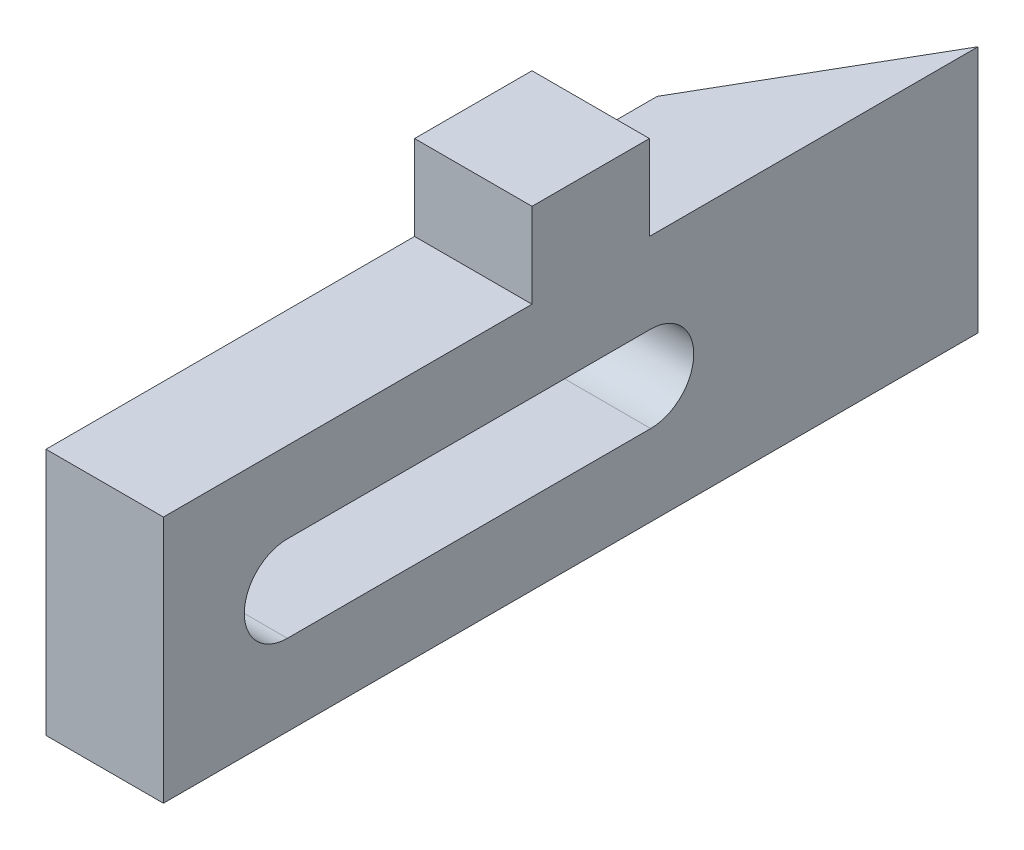
ISO-10303-21;
HEADER;
FILE_DESCRIPTION(('STEP AP214'),'2;1');
FILE_NAME('part.step','',(''),(''),'','','');
FILE_SCHEMA(('AUTOMOTIVE_DESIGN { 1 0 10303 214 1 1 1 1 }'));
ENDSEC;
DATA;
#1=APPLICATION_CONTEXT('core data for automotive mechanical design processes');
#2=APPLICATION_PROTOCOL_DEFINITION('international standard','automotive_design',2000,#1);
#3=PRODUCT_CONTEXT('',#1,'mechanical');
#4=PRODUCT('Part','Part','',(#3));
#5=PRODUCT_RELATED_PRODUCT_CATEGORY('part','',(#4));
#6=PRODUCT_DEFINITION_FORMATION('','',#4);
#7=PRODUCT_DEFINITION_CONTEXT('part definition',#1,'design');
#8=PRODUCT_DEFINITION('design','',#6,#7);
#9=PRODUCT_DEFINITION_SHAPE('','',#8);
#10=(LENGTH_UNIT() NAMED_UNIT(*) SI_UNIT(.MILLI.,.METRE.));
#11=(NAMED_UNIT(*) PLANE_ANGLE_UNIT() SI_UNIT($,.RADIAN.));
#12=(NAMED_UNIT(*) SI_UNIT($,.STERADIAN.) SOLID_ANGLE_UNIT());
#13=UNCERTAINTY_MEASURE_WITH_UNIT(LENGTH_MEASURE(1.E-05),#10,'distance_accuracy_value','');
#14=(GEOMETRIC_REPRESENTATION_CONTEXT(3) GLOBAL_UNCERTAINTY_ASSIGNED_CONTEXT((#13)) GLOBAL_UNIT_ASSIGNED_CONTEXT((#10,
#11,#12)) REPRESENTATION_CONTEXT('',''));
#15=CARTESIAN_POINT('',(0.,0.,0.));
#16=DIRECTION('',(0.,0.,1.));
#17=DIRECTION('',(1.,0.,0.));
#18=AXIS2_PLACEMENT_3D('',#15,#16,#17);
#19=CARTESIAN_POINT('',(0.,19.,0.));
#20=DIRECTION('',(0.,1.,0.));
#21=DIRECTION('',(0.,0.,1.));
#22=AXIS2_PLACEMENT_3D('',#19,#20,#21);
#23=PLANE('',#22);
#24=DIRECTION('',(-1.,0.,0.));
#25=VECTOR('',#24,1.);
#26=CARTESIAN_POINT('',(24.5,19.,-17.25));
#27=LINE('',#26,#25);
#28=CARTESIAN_POINT('',(24.5,19.,-17.25));
#29=VERTEX_POINT('',#28);
#30=CARTESIAN_POINT('',(15.5,19.,-17.25));
#31=VERTEX_POINT('',#30);
#32=EDGE_CURVE('E50',#29,#31,#27,.T.);
#33=ORIENTED_EDGE('',*,*,#32,.F.);
#34=DIRECTION('',(0.,0.,-1.));
#35=VECTOR('',#34,1.);
#36=CARTESIAN_POINT('',(24.5,19.,20.));
#37=LINE('',#36,#35);
#38=CARTESIAN_POINT('',(24.5,19.,-42.4352447854375));
#39=VERTEX_POINT('',#38);
#40=EDGE_CURVE('E229',#29,#39,#37,.T.);
#41=ORIENTED_EDGE('',*,*,#40,.T.);
#42=DIRECTION('',(-0.5,0.,0.866025403784439));
#43=VECTOR('',#42,1.);
#44=CARTESIAN_POINT('',(24.5,19.,-42.4352447854375));
#45=LINE('',#44,#43);
#46=CARTESIAN_POINT('',(15.5,19.,-26.8467875173176));
#47=VERTEX_POINT('',#46);
#48=EDGE_CURVE('E197',#39,#47,#45,.T.);
#49=ORIENTED_EDGE('',*,*,#48,.T.);
#50=DIRECTION('',(0.,0.,1.));
#51=VECTOR('',#50,1.);
#52=CARTESIAN_POINT('',(15.5,19.,-26.8467875173176));
#53=LINE('',#52,#51);
#54=EDGE_CURVE('E209',#47,#31,#53,.T.);
#55=ORIENTED_EDGE('',*,*,#54,.T.);
#56=EDGE_LOOP('',(#33,#41,#49,#55));
#57=FACE_BOUND('',#56,.T.);
#58=ADVANCED_FACE('F33',(#57),#23,.T.);
#59=CARTESIAN_POINT('',(24.5,19.,-42.4352447854375));
#60=DIRECTION('',(0.866025403784439,0.,0.5));
#61=DIRECTION('',(0.5,0.,-0.866025403784439));
#62=AXIS2_PLACEMENT_3D('',#59,#60,#61);
#63=PLANE('',#62);
#64=DIRECTION('',(-0.5,0.,0.866025403784439));
#65=VECTOR('',#64,1.);
#66=CARTESIAN_POINT('',(24.5,0.,-42.4352447854375));
#67=LINE('',#66,#65);
#68=CARTESIAN_POINT('',(24.5,0.,-42.4352447854375));
#69=VERTEX_POINT('',#68);
#70=CARTESIAN_POINT('',(15.5,0.,-26.8467875173176));
#71=VERTEX_POINT('',#70);
#72=EDGE_CURVE('E190',#69,#71,#67,.T.);
#73=ORIENTED_EDGE('',*,*,#72,.T.);
#74=DIRECTION('',(0.,-1.,0.));
#75=VECTOR('',#74,1.);
#76=CARTESIAN_POINT('',(15.5,19.,-26.8467875173176));
#77=LINE('',#76,#75);
#78=EDGE_CURVE('E11',#47,#71,#77,.T.);
#79=ORIENTED_EDGE('',*,*,#78,.F.);
#80=ORIENTED_EDGE('',*,*,#48,.F.);
#81=DIRECTION('',(0.,-1.,0.));
#82=VECTOR('',#81,1.);
#83=CARTESIAN_POINT('',(24.5,19.,-42.4352447854375));
#84=LINE('',#83,#82);
#85=EDGE_CURVE('E216',#39,#69,#84,.T.);
#86=ORIENTED_EDGE('',*,*,#85,.T.);
#87=EDGE_LOOP('',(#73,#79,#80,#86));
#88=FACE_BOUND('',#87,.T.);
#89=ADVANCED_FACE('F35',(#88),#63,.F.);
#90=CARTESIAN_POINT('',(15.5,19.,-26.8467875173176));
#91=DIRECTION('',(1.,0.,0.));
#92=DIRECTION('',(0.,0.,-1.));
#93=AXIS2_PLACEMENT_3D('',#90,#91,#92);
#94=PLANE('',#93);
#95=DIRECTION('',(0.,0.,1.));
#96=VECTOR('',#95,1.);
#97=CARTESIAN_POINT('',(15.5,6.2,-17.3467875173176));
#98=LINE('',#97,#96);
#99=CARTESIAN_POINT('',(15.5,6.2,-17.3467875173176));
#100=VERTEX_POINT('',#99);
#101=CARTESIAN_POINT('',(15.5,6.2,10.5));
#102=VERTEX_POINT('',#101);
#103=EDGE_CURVE('E149',#100,#102,#98,.T.);
#104=ORIENTED_EDGE('',*,*,#103,.F.);
#105=CARTESIAN_POINT('',(15.5,9.5,-17.3467875173176));
#106=DIRECTION('',(-1.,0.,0.));
#107=DIRECTION('',(0.,0.,1.));
#108=AXIS2_PLACEMENT_3D('',#105,#106,#107);
#109=CIRCLE('',#108,3.3);
#110=CARTESIAN_POINT('',(15.5,12.8,-17.3467875173176));
#111=VERTEX_POINT('',#110);
#112=EDGE_CURVE('E147',#111,#100,#109,.T.);
#113=ORIENTED_EDGE('',*,*,#112,.F.);
#114=DIRECTION('',(0.,0.,-1.));
#115=VECTOR('',#114,1.);
#116=CARTESIAN_POINT('',(15.5,12.8,-17.3467875173176));
#117=LINE('',#116,#115);
#118=CARTESIAN_POINT('',(15.5,12.8,10.5));
#119=VERTEX_POINT('',#118);
#120=EDGE_CURVE('E171',#119,#111,#117,.T.);
#121=ORIENTED_EDGE('',*,*,#120,.F.);
#122=CARTESIAN_POINT('',(15.5,9.5,10.5));
#123=DIRECTION('',(-1.,0.,0.));
#124=DIRECTION('',(0.,0.,1.));
#125=AXIS2_PLACEMENT_3D('',#122,#123,#124);
#126=CIRCLE('',#125,3.3);
#127=EDGE_CURVE('E183',#102,#119,#126,.T.);
#128=ORIENTED_EDGE('',*,*,#127,.F.);
#129=EDGE_LOOP('',(#104,#113,#121,#128));
#130=FACE_BOUND('',#129,.T.);
#131=DIRECTION('',(0.,0.,1.));
#132=VECTOR('',#131,1.);
#133=CARTESIAN_POINT('',(15.5,0.,-26.8467875173176));
#134=LINE('',#133,#132);
#135=CARTESIAN_POINT('',(15.5,0.,20.));
#136=VERTEX_POINT('',#135);
#137=EDGE_CURVE('E223',#71,#136,#134,.T.);
#138=ORIENTED_EDGE('',*,*,#137,.T.);
#139=DIRECTION('',(0.,-1.,0.));
#140=VECTOR('',#139,1.);
#141=CARTESIAN_POINT('',(15.5,19.,20.));
#142=LINE('',#141,#140);
#143=CARTESIAN_POINT('',(15.5,19.,20.));
#144=VERTEX_POINT('',#143);
#145=EDGE_CURVE('E42',#144,#136,#142,.T.);
#146=ORIENTED_EDGE('',*,*,#145,.F.);
#147=CARTESIAN_POINT('',(15.5,19.,-8.25));
#148=VERTEX_POINT('',#147);
#149=EDGE_CURVE('E146',#148,#144,#53,.T.);
#150=ORIENTED_EDGE('',*,*,#149,.F.);
#151=DIRECTION('',(0.,-1.,0.));
#152=VECTOR('',#151,1.);
#153=CARTESIAN_POINT('',(15.5,25.5,-8.25));
#154=LINE('',#153,#152);
#155=CARTESIAN_POINT('',(15.5,25.5,-8.25));
#156=VERTEX_POINT('',#155);
#157=EDGE_CURVE('E128',#156,#148,#154,.T.);
#158=ORIENTED_EDGE('',*,*,#157,.F.);
#159=DIRECTION('',(0.,0.,1.));
#160=VECTOR('',#159,1.);
#161=CARTESIAN_POINT('',(15.5,25.5,-17.25));
#162=LINE('',#161,#160);
#163=CARTESIAN_POINT('',(15.5,25.5,-17.25));
#164=VERTEX_POINT('',#163);
#165=EDGE_CURVE('E134',#164,#156,#162,.T.);
#166=ORIENTED_EDGE('',*,*,#165,.F.);
#167=DIRECTION('',(0.,-1.,0.));
#168=VECTOR('',#167,1.);
#169=CARTESIAN_POINT('',(15.5,25.5,-17.25));
#170=LINE('',#169,#168);
#171=EDGE_CURVE('E160',#164,#31,#170,.T.);
#172=ORIENTED_EDGE('',*,*,#171,.T.);
#173=ORIENTED_EDGE('',*,*,#54,.F.);
#174=ORIENTED_EDGE('',*,*,#78,.T.);
#175=EDGE_LOOP('',(#138,#146,#150,#158,#166,#172,#173,#174));
#176=FACE_BOUND('',#175,.T.);
#177=ADVANCED_FACE('F144',(#130,#176),#94,.F.);
#178=CARTESIAN_POINT('',(15.5,19.,20.));
#179=DIRECTION('',(0.,0.,-1.));
#180=DIRECTION('',(-1.,0.,0.));
#181=AXIS2_PLACEMENT_3D('',#178,#179,#180);
#182=PLANE('',#181);
#183=DIRECTION('',(1.,0.,0.));
#184=VECTOR('',#183,1.);
#185=CARTESIAN_POINT('',(15.5,0.,20.));
#186=LINE('',#185,#184);
#187=CARTESIAN_POINT('',(24.5,0.,20.));
#188=VERTEX_POINT('',#187);
#189=EDGE_CURVE('E221',#136,#188,#186,.T.);
#190=ORIENTED_EDGE('',*,*,#189,.T.);
#191=DIRECTION('',(0.,-1.,0.));
#192=VECTOR('',#191,1.);
#193=CARTESIAN_POINT('',(24.5,19.,20.));
#194=LINE('',#193,#192);
#195=CARTESIAN_POINT('',(24.5,19.,20.));
#196=VERTEX_POINT('',#195);
#197=EDGE_CURVE('E213',#196,#188,#194,.T.);
#198=ORIENTED_EDGE('',*,*,#197,.F.);
#199=DIRECTION('',(1.,0.,0.));
#200=VECTOR('',#199,1.);
#201=CARTESIAN_POINT('',(15.5,19.,20.));
#202=LINE('',#201,#200);
#203=EDGE_CURVE('E203',#144,#196,#202,.T.);
#204=ORIENTED_EDGE('',*,*,#203,.F.);
#205=ORIENTED_EDGE('',*,*,#145,.T.);
#206=EDGE_LOOP('',(#190,#198,#204,#205));
#207=FACE_BOUND('',#206,.T.);
#208=ADVANCED_FACE('F237',(#207),#182,.F.);
#209=CARTESIAN_POINT('',(24.5,19.,20.));
#210=DIRECTION('',(-1.,0.,0.));
#211=DIRECTION('',(0.,0.,1.));
#212=AXIS2_PLACEMENT_3D('',#209,#210,#211);
#213=PLANE('',#212);
#214=DIRECTION('',(0.,0.,-1.));
#215=VECTOR('',#214,1.);
#216=CARTESIAN_POINT('',(24.5,12.8,-17.3467875173176));
#217=LINE('',#216,#215);
#218=CARTESIAN_POINT('',(24.5,12.8,10.5));
#219=VERTEX_POINT('',#218);
#220=CARTESIAN_POINT('',(24.5,12.8,-17.3467875173176));
#221=VERTEX_POINT('',#220);
#222=EDGE_CURVE('E177',#219,#221,#217,.T.);
#223=ORIENTED_EDGE('',*,*,#222,.T.);
#224=CARTESIAN_POINT('',(24.5,9.5,-17.3467875173176));
#225=DIRECTION('',(-1.,0.,0.));
#226=DIRECTION('',(0.,0.,1.));
#227=AXIS2_PLACEMENT_3D('',#224,#225,#226);
#228=CIRCLE('',#227,3.3);
#229=CARTESIAN_POINT('',(24.5,6.2,-17.3467875173176));
#230=VERTEX_POINT('',#229);
#231=EDGE_CURVE('E167',#221,#230,#228,.T.);
#232=ORIENTED_EDGE('',*,*,#231,.T.);
#233=DIRECTION('',(0.,0.,1.));
#234=VECTOR('',#233,1.);
#235=CARTESIAN_POINT('',(24.5,6.2,-17.3467875173176));
#236=LINE('',#235,#234);
#237=CARTESIAN_POINT('',(24.5,6.2,10.5));
#238=VERTEX_POINT('',#237);
#239=EDGE_CURVE('E170',#230,#238,#236,.T.);
#240=ORIENTED_EDGE('',*,*,#239,.T.);
#241=CARTESIAN_POINT('',(24.5,9.5,10.5));
#242=DIRECTION('',(-1.,0.,0.));
#243=DIRECTION('',(0.,0.,1.));
#244=AXIS2_PLACEMENT_3D('',#241,#242,#243);
#245=CIRCLE('',#244,3.3);
#246=EDGE_CURVE('E174',#238,#219,#245,.T.);
#247=ORIENTED_EDGE('',*,*,#246,.T.);
#248=EDGE_LOOP('',(#223,#232,#240,#247));
#249=FACE_BOUND('',#248,.T.);
#250=DIRECTION('',(0.,0.,-1.));
#251=VECTOR('',#250,1.);
#252=CARTESIAN_POINT('',(24.5,0.,20.));
#253=LINE('',#252,#251);
#254=EDGE_CURVE('E200',#188,#69,#253,.T.);
#255=ORIENTED_EDGE('',*,*,#254,.T.);
#256=ORIENTED_EDGE('',*,*,#85,.F.);
#257=ORIENTED_EDGE('',*,*,#40,.F.);
#258=DIRECTION('',(0.,-1.,0.));
#259=VECTOR('',#258,1.);
#260=CARTESIAN_POINT('',(24.5,25.5,-17.25));
#261=LINE('',#260,#259);
#262=CARTESIAN_POINT('',(24.5,25.5,-17.25));
#263=VERTEX_POINT('',#262);
#264=EDGE_CURVE('E151',#263,#29,#261,.T.);
#265=ORIENTED_EDGE('',*,*,#264,.F.);
#266=DIRECTION('',(0.,0.,-1.));
#267=VECTOR('',#266,1.);
#268=CARTESIAN_POINT('',(24.5,25.5,-8.25));
#269=LINE('',#268,#267);
#270=CARTESIAN_POINT('',(24.5,25.5,-8.25));
#271=VERTEX_POINT('',#270);
#272=EDGE_CURVE('E133',#271,#263,#269,.T.);
#273=ORIENTED_EDGE('',*,*,#272,.F.);
#274=DIRECTION('',(0.,-1.,0.));
#275=VECTOR('',#274,1.);
#276=CARTESIAN_POINT('',(24.5,25.5,-8.25));
#277=LINE('',#276,#275);
#278=CARTESIAN_POINT('',(24.5,19.,-8.25));
#279=VERTEX_POINT('',#278);
#280=EDGE_CURVE('E130',#271,#279,#277,.T.);
#281=ORIENTED_EDGE('',*,*,#280,.T.);
#282=EDGE_CURVE('E219',#196,#279,#37,.T.);
#283=ORIENTED_EDGE('',*,*,#282,.F.);
#284=ORIENTED_EDGE('',*,*,#197,.T.);
#285=EDGE_LOOP('',(#255,#256,#257,#265,#273,#281,#283,#284));
#286=FACE_BOUND('',#285,.T.);
#287=ADVANCED_FACE('F241',(#249,#286),#213,.F.);
#288=DIRECTION('',(1.,0.,0.));
#289=VECTOR('',#288,1.);
#290=CARTESIAN_POINT('',(15.5,19.,-8.25));
#291=LINE('',#290,#289);
#292=EDGE_CURVE('E58',#148,#279,#291,.T.);
#293=ORIENTED_EDGE('',*,*,#292,.F.);
#294=ORIENTED_EDGE('',*,*,#149,.T.);
#295=ORIENTED_EDGE('',*,*,#203,.T.);
#296=ORIENTED_EDGE('',*,*,#282,.T.);
#297=EDGE_LOOP('',(#293,#294,#295,#296));
#298=FACE_BOUND('',#297,.T.);
#299=ADVANCED_FACE('F235',(#298),#23,.T.);
#300=CARTESIAN_POINT('',(0.,0.,0.));
#301=DIRECTION('',(0.,1.,0.));
#302=DIRECTION('',(0.,0.,1.));
#303=AXIS2_PLACEMENT_3D('',#300,#301,#302);
#304=PLANE('',#303);
#305=ORIENTED_EDGE('',*,*,#72,.F.);
#306=ORIENTED_EDGE('',*,*,#254,.F.);
#307=ORIENTED_EDGE('',*,*,#189,.F.);
#308=ORIENTED_EDGE('',*,*,#137,.F.);
#309=EDGE_LOOP('',(#305,#306,#307,#308));
#310=FACE_BOUND('',#309,.T.);
#311=ADVANCED_FACE('F268',(#310),#304,.F.);
#312=CARTESIAN_POINT('',(24.5,9.5,-17.3467875173176));
#313=DIRECTION('',(-1.,0.,0.));
#314=DIRECTION('',(0.,0.,1.));
#315=AXIS2_PLACEMENT_3D('',#312,#313,#314);
#316=CYLINDRICAL_SURFACE('',#315,3.3);
#317=ORIENTED_EDGE('',*,*,#112,.T.);
#318=DIRECTION('',(-1.,0.,0.));
#319=VECTOR('',#318,1.);
#320=CARTESIAN_POINT('',(24.5,6.2,-17.3467875173176));
#321=LINE('',#320,#319);
#322=EDGE_CURVE('E179',#230,#100,#321,.T.);
#323=ORIENTED_EDGE('',*,*,#322,.F.);
#324=ORIENTED_EDGE('',*,*,#231,.F.);
#325=DIRECTION('',(-1.,0.,0.));
#326=VECTOR('',#325,1.);
#327=CARTESIAN_POINT('',(24.5,12.8,-17.3467875173176));
#328=LINE('',#327,#326);
#329=EDGE_CURVE('E188',#221,#111,#328,.T.);
#330=ORIENTED_EDGE('',*,*,#329,.T.);
#331=EDGE_LOOP('',(#317,#323,#324,#330));
#332=FACE_BOUND('',#331,.T.);
#333=ADVANCED_FACE('F274',(#332),#316,.F.);
#334=CARTESIAN_POINT('',(24.5,12.8,-17.3467875173176));
#335=DIRECTION('',(0.,1.,0.));
#336=DIRECTION('',(0.,0.,1.));
#337=AXIS2_PLACEMENT_3D('',#334,#335,#336);
#338=PLANE('',#337);
#339=ORIENTED_EDGE('',*,*,#120,.T.);
#340=ORIENTED_EDGE('',*,*,#329,.F.);
#341=ORIENTED_EDGE('',*,*,#222,.F.);
#342=DIRECTION('',(-1.,0.,0.));
#343=VECTOR('',#342,1.);
#344=CARTESIAN_POINT('',(24.5,12.8,10.5));
#345=LINE('',#344,#343);
#346=EDGE_CURVE('E191',#219,#119,#345,.T.);
#347=ORIENTED_EDGE('',*,*,#346,.T.);
#348=EDGE_LOOP('',(#339,#340,#341,#347));
#349=FACE_BOUND('',#348,.T.);
#350=ADVANCED_FACE('F297',(#349),#338,.F.);
#351=CARTESIAN_POINT('',(24.5,9.5,10.5));
#352=DIRECTION('',(-1.,0.,0.));
#353=DIRECTION('',(0.,0.,1.));
#354=AXIS2_PLACEMENT_3D('',#351,#352,#353);
#355=CYLINDRICAL_SURFACE('',#354,3.3);
#356=ORIENTED_EDGE('',*,*,#127,.T.);
#357=ORIENTED_EDGE('',*,*,#346,.F.);
#358=ORIENTED_EDGE('',*,*,#246,.F.);
#359=DIRECTION('',(-1.,0.,0.));
#360=VECTOR('',#359,1.);
#361=CARTESIAN_POINT('',(24.5,6.2,10.5));
#362=LINE('',#361,#360);
#363=EDGE_CURVE('E193',#238,#102,#362,.T.);
#364=ORIENTED_EDGE('',*,*,#363,.T.);
#365=EDGE_LOOP('',(#356,#357,#358,#364));
#366=FACE_BOUND('',#365,.T.);
#367=ADVANCED_FACE('F299',(#366),#355,.F.);
#368=CARTESIAN_POINT('',(24.5,6.2,-17.3467875173176));
#369=DIRECTION('',(0.,-1.,0.));
#370=DIRECTION('',(0.,0.,-1.));
#371=AXIS2_PLACEMENT_3D('',#368,#369,#370);
#372=PLANE('',#371);
#373=ORIENTED_EDGE('',*,*,#103,.T.);
#374=ORIENTED_EDGE('',*,*,#363,.F.);
#375=ORIENTED_EDGE('',*,*,#239,.F.);
#376=ORIENTED_EDGE('',*,*,#322,.T.);
#377=EDGE_LOOP('',(#373,#374,#375,#376));
#378=FACE_BOUND('',#377,.T.);
#379=ADVANCED_FACE('F255',(#378),#372,.F.);
#380=CARTESIAN_POINT('',(15.5,25.5,-8.25));
#381=DIRECTION('',(0.,0.,-1.));
#382=DIRECTION('',(-1.,0.,0.));
#383=AXIS2_PLACEMENT_3D('',#380,#381,#382);
#384=PLANE('',#383);
#385=ORIENTED_EDGE('',*,*,#292,.T.);
#386=ORIENTED_EDGE('',*,*,#280,.F.);
#387=DIRECTION('',(1.,0.,0.));
#388=VECTOR('',#387,1.);
#389=CARTESIAN_POINT('',(15.5,25.5,-8.25));
#390=LINE('',#389,#388);
#391=EDGE_CURVE('E124',#156,#271,#390,.T.);
#392=ORIENTED_EDGE('',*,*,#391,.F.);
#393=ORIENTED_EDGE('',*,*,#157,.T.);
#394=EDGE_LOOP('',(#385,#386,#392,#393));
#395=FACE_BOUND('',#394,.T.);
#396=ADVANCED_FACE('F126',(#395),#384,.F.);
#397=CARTESIAN_POINT('',(24.5,25.5,-17.25));
#398=DIRECTION('',(0.,0.,1.));
#399=DIRECTION('',(1.,0.,0.));
#400=AXIS2_PLACEMENT_3D('',#397,#398,#399);
#401=PLANE('',#400);
#402=ORIENTED_EDGE('',*,*,#32,.T.);
#403=ORIENTED_EDGE('',*,*,#171,.F.);
#404=DIRECTION('',(-1.,0.,0.));
#405=VECTOR('',#404,1.);
#406=CARTESIAN_POINT('',(24.5,25.5,-17.25));
#407=LINE('',#406,#405);
#408=EDGE_CURVE('E139',#263,#164,#407,.T.);
#409=ORIENTED_EDGE('',*,*,#408,.F.);
#410=ORIENTED_EDGE('',*,*,#264,.T.);
#411=EDGE_LOOP('',(#402,#403,#409,#410));
#412=FACE_BOUND('',#411,.T.);
#413=ADVANCED_FACE('F247',(#412),#401,.F.);
#414=CARTESIAN_POINT('',(0.,25.5,0.));
#415=DIRECTION('',(0.,1.,0.));
#416=DIRECTION('',(0.,0.,1.));
#417=AXIS2_PLACEMENT_3D('',#414,#415,#416);
#418=PLANE('',#417);
#419=ORIENTED_EDGE('',*,*,#165,.T.);
#420=ORIENTED_EDGE('',*,*,#391,.T.);
#421=ORIENTED_EDGE('',*,*,#272,.T.);
#422=ORIENTED_EDGE('',*,*,#408,.T.);
#423=EDGE_LOOP('',(#419,#420,#421,#422));
#424=FACE_BOUND('',#423,.T.);
#425=ADVANCED_FACE('F137',(#424),#418,.T.);
#426=CLOSED_SHELL('',(#58,#89,#177,#208,#287,#299,#311,#333,#350,#367,#379,#396,#413,#425));
#427=MANIFOLD_SOLID_BREP('B2',#426);
#428=ADVANCED_BREP_SHAPE_REPRESENTATION('',(#18,#427),#14);
#429=SHAPE_DEFINITION_REPRESENTATION(#9,#428);
ENDSEC;
END-ISO-10303-21;
